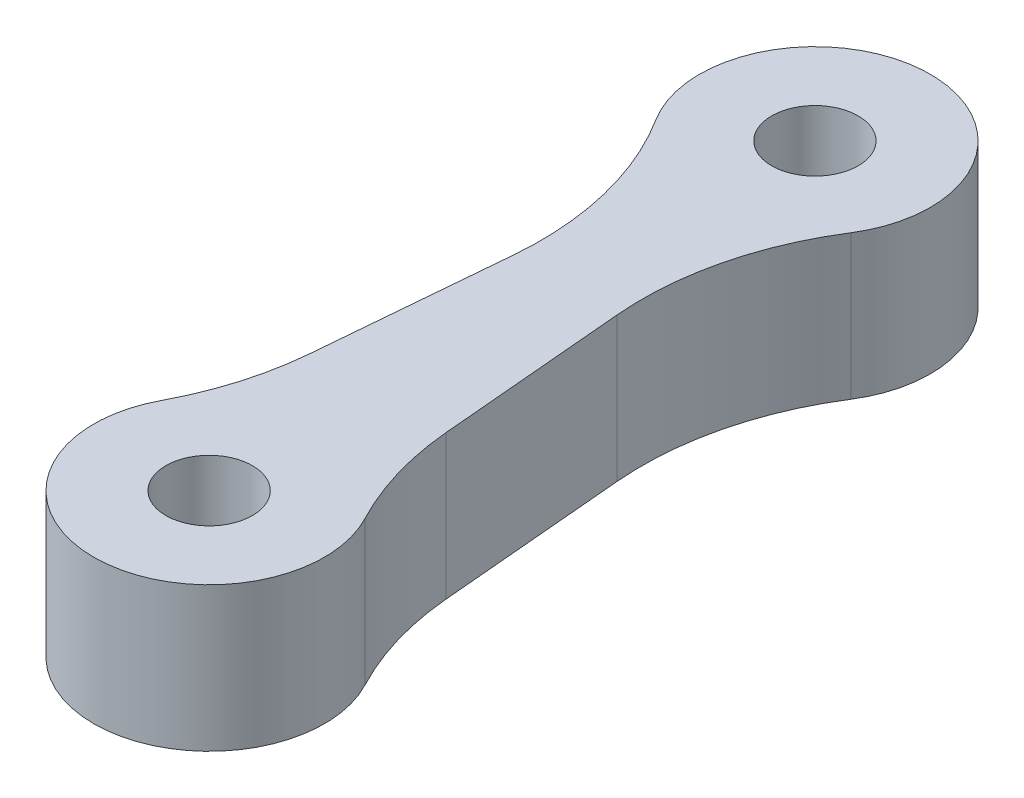
ISO-10303-21;
HEADER;
FILE_DESCRIPTION(('STEP AP214'),'2;1');
FILE_NAME('part.step','',(''),(''),'','','');
FILE_SCHEMA(('AUTOMOTIVE_DESIGN { 1 0 10303 214 1 1 1 1 }'));
ENDSEC;
DATA;
#1=APPLICATION_CONTEXT('core data for automotive mechanical design processes');
#2=APPLICATION_PROTOCOL_DEFINITION('international standard','automotive_design',2000,#1);
#3=PRODUCT_CONTEXT('',#1,'mechanical');
#4=PRODUCT('Part','Part','',(#3));
#5=PRODUCT_RELATED_PRODUCT_CATEGORY('part','',(#4));
#6=PRODUCT_DEFINITION_FORMATION('','',#4);
#7=PRODUCT_DEFINITION_CONTEXT('part definition',#1,'design');
#8=PRODUCT_DEFINITION('design','',#6,#7);
#9=PRODUCT_DEFINITION_SHAPE('','',#8);
#10=(LENGTH_UNIT() NAMED_UNIT(*) SI_UNIT(.MILLI.,.METRE.));
#11=(NAMED_UNIT(*) PLANE_ANGLE_UNIT() SI_UNIT($,.RADIAN.));
#12=(NAMED_UNIT(*) SI_UNIT($,.STERADIAN.) SOLID_ANGLE_UNIT());
#13=UNCERTAINTY_MEASURE_WITH_UNIT(LENGTH_MEASURE(1.E-05),#10,'distance_accuracy_value','');
#14=(GEOMETRIC_REPRESENTATION_CONTEXT(3) GLOBAL_UNCERTAINTY_ASSIGNED_CONTEXT((#13)) GLOBAL_UNIT_ASSIGNED_CONTEXT((#10,
#11,#12)) REPRESENTATION_CONTEXT('',''));
#15=CARTESIAN_POINT('',(0.,0.,0.));
#16=DIRECTION('',(0.,0.,1.));
#17=DIRECTION('',(1.,0.,0.));
#18=AXIS2_PLACEMENT_3D('',#15,#16,#17);
#19=CARTESIAN_POINT('',(0.,10.,42.));
#20=DIRECTION('',(0.,-1.,0.));
#21=DIRECTION('',(0.,0.,-1.));
#22=AXIS2_PLACEMENT_3D('',#19,#20,#21);
#23=CYLINDRICAL_SURFACE('',#22,8.);
#24=CARTESIAN_POINT('',(0.,0.,42.));
#25=DIRECTION('',(0.,1.,0.));
#26=DIRECTION('',(0.,0.,1.));
#27=AXIS2_PLACEMENT_3D('',#24,#25,#26);
#28=CIRCLE('',#27,8.);
#29=CARTESIAN_POINT('',(-7.07567247600929,0.,38.2670575932323));
#30=VERTEX_POINT('',#29);
#31=CARTESIAN_POINT('',(7.07567247600916,0.,38.267057593232));
#32=VERTEX_POINT('',#31);
#33=EDGE_CURVE('E142',#30,#32,#28,.T.);
#34=ORIENTED_EDGE('',*,*,#33,.T.);
#35=DIRECTION('',(0.,-1.,0.));
#36=VECTOR('',#35,1.);
#37=CARTESIAN_POINT('',(7.07567247600916,10.,38.267057593232));
#38=LINE('',#37,#36);
#39=CARTESIAN_POINT('',(7.07567247600916,10.,38.267057593232));
#40=VERTEX_POINT('',#39);
#41=EDGE_CURVE('E11',#40,#32,#38,.T.);
#42=ORIENTED_EDGE('',*,*,#41,.F.);
#43=CARTESIAN_POINT('',(0.,10.,42.));
#44=DIRECTION('',(0.,1.,0.));
#45=DIRECTION('',(0.,0.,1.));
#46=AXIS2_PLACEMENT_3D('',#43,#44,#45);
#47=CIRCLE('',#46,8.);
#48=CARTESIAN_POINT('',(-7.07567247600929,10.,38.2670575932323));
#49=VERTEX_POINT('',#48);
#50=EDGE_CURVE('E308',#49,#40,#47,.T.);
#51=ORIENTED_EDGE('',*,*,#50,.F.);
#52=DIRECTION('',(0.,-1.,0.));
#53=VECTOR('',#52,1.);
#54=CARTESIAN_POINT('',(-7.07567247600929,10.,38.2670575932323));
#55=LINE('',#54,#53);
#56=EDGE_CURVE('E54',#49,#30,#55,.T.);
#57=ORIENTED_EDGE('',*,*,#56,.T.);
#58=EDGE_LOOP('',(#34,#42,#51,#57));
#59=FACE_BOUND('',#58,.T.);
#60=ADVANCED_FACE('F37',(#59),#23,.T.);
#61=CARTESIAN_POINT('',(25.6493127255332,10.,28.4680837754661));
#62=DIRECTION('',(0.,-1.,0.));
#63=DIRECTION('',(0.,0.,-1.));
#64=AXIS2_PLACEMENT_3D('',#61,#62,#63);
#65=CYLINDRICAL_SURFACE('',#64,21.);
#66=CARTESIAN_POINT('',(25.6493127255332,0.,28.4680837754661));
#67=DIRECTION('',(0.,1.,0.));
#68=DIRECTION('',(0.,0.,1.));
#69=AXIS2_PLACEMENT_3D('',#66,#67,#68);
#70=CIRCLE('',#69,21.);
#71=CARTESIAN_POINT('',(4.72922406560649,0.,30.2983543731668));
#72=VERTEX_POINT('',#71);
#73=EDGE_CURVE('E144',#32,#72,#70,.F.);
#74=ORIENTED_EDGE('',*,*,#73,.T.);
#75=DIRECTION('',(0.,-1.,0.));
#76=VECTOR('',#75,1.);
#77=CARTESIAN_POINT('',(4.72922406560649,10.,30.2983543731668));
#78=LINE('',#77,#76);
#79=CARTESIAN_POINT('',(4.72922406560649,10.,30.2983543731668));
#80=VERTEX_POINT('',#79);
#81=EDGE_CURVE('E46',#80,#72,#78,.T.);
#82=ORIENTED_EDGE('',*,*,#81,.F.);
#83=CARTESIAN_POINT('',(25.6493127255332,10.,28.4680837754661));
#84=DIRECTION('',(0.,1.,0.));
#85=DIRECTION('',(0.,0.,1.));
#86=AXIS2_PLACEMENT_3D('',#83,#84,#85);
#87=CIRCLE('',#86,21.);
#88=EDGE_CURVE('E93',#40,#80,#87,.F.);
#89=ORIENTED_EDGE('',*,*,#88,.F.);
#90=ORIENTED_EDGE('',*,*,#41,.T.);
#91=EDGE_LOOP('',(#74,#82,#89,#90));
#92=FACE_BOUND('',#91,.T.);
#93=ADVANCED_FACE('F175',(#92),#65,.F.);
#94=CARTESIAN_POINT('',(2.06267328397039,10.,-0.180460528905185));
#95=DIRECTION('',(0.996194698091746,0.,-0.0871557427476521));
#96=DIRECTION('',(-0.0871557427476521,0.,-0.996194698091746));
#97=AXIS2_PLACEMENT_3D('',#94,#95,#96);
#98=PLANE('',#97);
#99=DIRECTION('',(0.0871557427476521,0.,0.996194698091746));
#100=VECTOR('',#99,1.);
#101=CARTESIAN_POINT('',(2.06267328397039,0.,-0.180460528905185));
#102=LINE('',#101,#100);
#103=CARTESIAN_POINT('',(3.59411058104261,0.,17.323947875031));
#104=VERTEX_POINT('',#103);
#105=EDGE_CURVE('E147',#104,#72,#102,.T.);
#106=ORIENTED_EDGE('',*,*,#105,.F.);
#107=DIRECTION('',(0.,-1.,0.));
#108=VECTOR('',#107,1.);
#109=CARTESIAN_POINT('',(3.59411058104261,10.,17.323947875031));
#110=LINE('',#109,#108);
#111=CARTESIAN_POINT('',(3.59411058104261,10.,17.323947875031));
#112=VERTEX_POINT('',#111);
#113=EDGE_CURVE('E168',#112,#104,#110,.T.);
#114=ORIENTED_EDGE('',*,*,#113,.F.);
#115=DIRECTION('',(0.0871557427476521,0.,0.996194698091746));
#116=VECTOR('',#115,1.);
#117=CARTESIAN_POINT('',(2.06267328397039,10.,-0.180460528905185));
#118=LINE('',#117,#116);
#119=EDGE_CURVE('E174',#112,#80,#118,.T.);
#120=ORIENTED_EDGE('',*,*,#119,.T.);
#121=ORIENTED_EDGE('',*,*,#81,.T.);
#122=EDGE_LOOP('',(#106,#114,#120,#121));
#123=FACE_BOUND('',#122,.T.);
#124=ADVANCED_FACE('F172',(#123),#98,.T.);
#125=CARTESIAN_POINT('',(24.5141992409693,10.,15.4936772773303));
#126=DIRECTION('',(0.,-1.,0.));
#127=DIRECTION('',(0.,0.,-1.));
#128=AXIS2_PLACEMENT_3D('',#125,#126,#127);
#129=CYLINDRICAL_SURFACE('',#128,21.);
#130=CARTESIAN_POINT('',(24.5141992409693,0.,15.4936772773303));
#131=DIRECTION('',(0.,1.,0.));
#132=DIRECTION('',(0.,0.,1.));
#133=AXIS2_PLACEMENT_3D('',#130,#131,#132);
#134=CIRCLE('',#133,21.);
#135=CARTESIAN_POINT('',(6.7625377216467,0.,4.27411786960836));
#136=VERTEX_POINT('',#135);
#137=EDGE_CURVE('E150',#104,#136,#134,.F.);
#138=ORIENTED_EDGE('',*,*,#137,.T.);
#139=DIRECTION('',(0.,-1.,0.));
#140=VECTOR('',#139,1.);
#141=CARTESIAN_POINT('',(6.7625377216467,10.,4.27411786960836));
#142=LINE('',#141,#140);
#143=CARTESIAN_POINT('',(6.7625377216467,10.,4.27411786960836));
#144=VERTEX_POINT('',#143);
#145=EDGE_CURVE('E165',#144,#136,#142,.T.);
#146=ORIENTED_EDGE('',*,*,#145,.F.);
#147=CARTESIAN_POINT('',(24.5141992409693,10.,15.4936772773303));
#148=DIRECTION('',(0.,1.,0.));
#149=DIRECTION('',(0.,0.,1.));
#150=AXIS2_PLACEMENT_3D('',#147,#148,#149);
#151=CIRCLE('',#150,21.);
#152=EDGE_CURVE('E131',#112,#144,#151,.F.);
#153=ORIENTED_EDGE('',*,*,#152,.F.);
#154=ORIENTED_EDGE('',*,*,#113,.T.);
#155=EDGE_LOOP('',(#138,#146,#153,#154));
#156=FACE_BOUND('',#155,.T.);
#157=ADVANCED_FACE('F183',(#156),#129,.F.);
#158=CARTESIAN_POINT('',(0.,10.,0.));
#159=DIRECTION('',(0.,-1.,0.));
#160=DIRECTION('',(0.,0.,-1.));
#161=AXIS2_PLACEMENT_3D('',#158,#159,#160);
#162=CYLINDRICAL_SURFACE('',#161,8.);
#163=CARTESIAN_POINT('',(0.,0.,0.));
#164=DIRECTION('',(0.,1.,0.));
#165=DIRECTION('',(0.,0.,1.));
#166=AXIS2_PLACEMENT_3D('',#163,#164,#165);
#167=CIRCLE('',#166,8.);
#168=CARTESIAN_POINT('',(-6.76253772164675,0.,4.27411786960827));
#169=VERTEX_POINT('',#168);
#170=EDGE_CURVE('E152',#136,#169,#167,.T.);
#171=ORIENTED_EDGE('',*,*,#170,.T.);
#172=DIRECTION('',(0.,-1.,0.));
#173=VECTOR('',#172,1.);
#174=CARTESIAN_POINT('',(-6.76253772164675,10.,4.27411786960827));
#175=LINE('',#174,#173);
#176=CARTESIAN_POINT('',(-6.76253772164675,10.,4.27411786960827));
#177=VERTEX_POINT('',#176);
#178=EDGE_CURVE('E118',#177,#169,#175,.T.);
#179=ORIENTED_EDGE('',*,*,#178,.F.);
#180=CARTESIAN_POINT('',(0.,10.,0.));
#181=DIRECTION('',(0.,1.,0.));
#182=DIRECTION('',(0.,0.,1.));
#183=AXIS2_PLACEMENT_3D('',#180,#181,#182);
#184=CIRCLE('',#183,8.);
#185=EDGE_CURVE('E128',#144,#177,#184,.T.);
#186=ORIENTED_EDGE('',*,*,#185,.F.);
#187=ORIENTED_EDGE('',*,*,#145,.T.);
#188=EDGE_LOOP('',(#171,#179,#186,#187));
#189=FACE_BOUND('',#188,.T.);
#190=ADVANCED_FACE('F186',(#189),#162,.T.);
#191=CARTESIAN_POINT('',(-24.5141992409695,10.,15.49367727733));
#192=DIRECTION('',(0.,-1.,0.));
#193=DIRECTION('',(0.,0.,-1.));
#194=AXIS2_PLACEMENT_3D('',#191,#192,#193);
#195=CYLINDRICAL_SURFACE('',#194,21.);
#196=CARTESIAN_POINT('',(-24.5141992409695,0.,15.49367727733));
#197=DIRECTION('',(0.,1.,0.));
#198=DIRECTION('',(0.,0.,1.));
#199=AXIS2_PLACEMENT_3D('',#196,#197,#198);
#200=CIRCLE('',#199,21.);
#201=CARTESIAN_POINT('',(-3.59411058104284,0.,17.3239478750309));
#202=VERTEX_POINT('',#201);
#203=EDGE_CURVE('E115',#202,#169,#200,.T.);
#204=ORIENTED_EDGE('',*,*,#203,.F.);
#205=DIRECTION('',(0.,-1.,0.));
#206=VECTOR('',#205,1.);
#207=CARTESIAN_POINT('',(-3.59411058104284,10.,17.3239478750309));
#208=LINE('',#207,#206);
#209=CARTESIAN_POINT('',(-3.59411058104284,10.,17.3239478750309));
#210=VERTEX_POINT('',#209);
#211=EDGE_CURVE('E109',#210,#202,#208,.T.);
#212=ORIENTED_EDGE('',*,*,#211,.F.);
#213=CARTESIAN_POINT('',(-24.5141992409695,10.,15.49367727733));
#214=DIRECTION('',(0.,1.,0.));
#215=DIRECTION('',(0.,0.,1.));
#216=AXIS2_PLACEMENT_3D('',#213,#214,#215);
#217=CIRCLE('',#216,21.);
#218=EDGE_CURVE('E113',#210,#177,#217,.T.);
#219=ORIENTED_EDGE('',*,*,#218,.T.);
#220=ORIENTED_EDGE('',*,*,#178,.T.);
#221=EDGE_LOOP('',(#204,#212,#219,#220));
#222=FACE_BOUND('',#221,.T.);
#223=ADVANCED_FACE('F111',(#222),#195,.F.);
#224=CARTESIAN_POINT('',(-2.06267328397041,10.,-0.180460528905213));
#225=DIRECTION('',(0.996194698091745,0.,0.0871557427476646));
#226=DIRECTION('',(0.0871557427476646,0.,-0.996194698091745));
#227=AXIS2_PLACEMENT_3D('',#224,#225,#226);
#228=PLANE('',#227);
#229=DIRECTION('',(-0.0871557427476646,0.,0.996194698091745));
#230=VECTOR('',#229,1.);
#231=CARTESIAN_POINT('',(-2.06267328397041,0.,-0.180460528905213));
#232=LINE('',#231,#230);
#233=CARTESIAN_POINT('',(-4.72922406560701,0.,30.2983543731681));
#234=VERTEX_POINT('',#233);
#235=EDGE_CURVE('E156',#202,#234,#232,.T.);
#236=ORIENTED_EDGE('',*,*,#235,.T.);
#237=DIRECTION('',(0.,-1.,0.));
#238=VECTOR('',#237,1.);
#239=CARTESIAN_POINT('',(-4.72922406560701,10.,30.2983543731681));
#240=LINE('',#239,#238);
#241=CARTESIAN_POINT('',(-4.72922406560701,10.,30.2983543731681));
#242=VERTEX_POINT('',#241);
#243=EDGE_CURVE('E81',#242,#234,#240,.T.);
#244=ORIENTED_EDGE('',*,*,#243,.F.);
#245=DIRECTION('',(-0.0871557427476646,0.,0.996194698091745));
#246=VECTOR('',#245,1.);
#247=CARTESIAN_POINT('',(-2.06267328397041,10.,-0.180460528905213));
#248=LINE('',#247,#246);
#249=EDGE_CURVE('E120',#210,#242,#248,.T.);
#250=ORIENTED_EDGE('',*,*,#249,.F.);
#251=ORIENTED_EDGE('',*,*,#211,.T.);
#252=EDGE_LOOP('',(#236,#244,#250,#251));
#253=FACE_BOUND('',#252,.T.);
#254=ADVANCED_FACE('F121',(#253),#228,.F.);
#255=CARTESIAN_POINT('',(0.,10.,0.));
#256=DIRECTION('',(0.,-1.,0.));
#257=DIRECTION('',(0.,0.,-1.));
#258=AXIS2_PLACEMENT_3D('',#255,#256,#257);
#259=CYLINDRICAL_SURFACE('',#258,3.);
#260=CARTESIAN_POINT('',(0.,10.,0.));
#261=DIRECTION('',(0.,1.,0.));
#262=DIRECTION('',(0.,0.,1.));
#263=AXIS2_PLACEMENT_3D('',#260,#261,#262);
#264=CIRCLE('',#263,3.);
#265=CARTESIAN_POINT('',(0.,10.,3.));
#266=VERTEX_POINT('',#265);
#267=EDGE_CURVE('E215',#266,#266,#264,.T.);
#268=ORIENTED_EDGE('',*,*,#267,.T.);
#269=EDGE_LOOP('',(#268));
#270=FACE_BOUND('',#269,.T.);
#271=CARTESIAN_POINT('',(0.,0.,0.));
#272=DIRECTION('',(0.,1.,0.));
#273=DIRECTION('',(0.,0.,1.));
#274=AXIS2_PLACEMENT_3D('',#271,#272,#273);
#275=CIRCLE('',#274,3.);
#276=CARTESIAN_POINT('',(0.,0.,3.));
#277=VERTEX_POINT('',#276);
#278=EDGE_CURVE('E139',#277,#277,#275,.T.);
#279=ORIENTED_EDGE('',*,*,#278,.F.);
#280=EDGE_LOOP('',(#279));
#281=FACE_BOUND('',#280,.T.);
#282=ADVANCED_FACE('F196',(#270,#281),#259,.F.);
#283=CARTESIAN_POINT('',(0.,10.,42.));
#284=DIRECTION('',(0.,-1.,0.));
#285=DIRECTION('',(0.,0.,-1.));
#286=AXIS2_PLACEMENT_3D('',#283,#284,#285);
#287=CYLINDRICAL_SURFACE('',#286,3.);
#288=CARTESIAN_POINT('',(0.,10.,42.));
#289=DIRECTION('',(0.,1.,0.));
#290=DIRECTION('',(0.,0.,1.));
#291=AXIS2_PLACEMENT_3D('',#288,#289,#290);
#292=CIRCLE('',#291,3.);
#293=CARTESIAN_POINT('',(0.,10.,45.));
#294=VERTEX_POINT('',#293);
#295=EDGE_CURVE('E161',#294,#294,#292,.T.);
#296=ORIENTED_EDGE('',*,*,#295,.T.);
#297=EDGE_LOOP('',(#296));
#298=FACE_BOUND('',#297,.T.);
#299=CARTESIAN_POINT('',(0.,0.,42.));
#300=DIRECTION('',(0.,1.,0.));
#301=DIRECTION('',(0.,0.,1.));
#302=AXIS2_PLACEMENT_3D('',#299,#300,#301);
#303=CIRCLE('',#302,3.);
#304=CARTESIAN_POINT('',(0.,0.,45.));
#305=VERTEX_POINT('',#304);
#306=EDGE_CURVE('E136',#305,#305,#303,.T.);
#307=ORIENTED_EDGE('',*,*,#306,.F.);
#308=EDGE_LOOP('',(#307));
#309=FACE_BOUND('',#308,.T.);
#310=ADVANCED_FACE('F39',(#298,#309),#287,.F.);
#311=CARTESIAN_POINT('',(-25.6493127255337,10.,28.4680837754671));
#312=DIRECTION('',(0.,-1.,0.));
#313=DIRECTION('',(0.,0.,-1.));
#314=AXIS2_PLACEMENT_3D('',#311,#312,#313);
#315=CYLINDRICAL_SURFACE('',#314,21.);
#316=CARTESIAN_POINT('',(-25.6493127255337,0.,28.4680837754671));
#317=DIRECTION('',(0.,1.,0.));
#318=DIRECTION('',(0.,0.,1.));
#319=AXIS2_PLACEMENT_3D('',#316,#317,#318);
#320=CIRCLE('',#319,21.);
#321=EDGE_CURVE('E158',#30,#234,#320,.T.);
#322=ORIENTED_EDGE('',*,*,#321,.F.);
#323=ORIENTED_EDGE('',*,*,#56,.F.);
#324=CARTESIAN_POINT('',(-25.6493127255337,10.,28.4680837754671));
#325=DIRECTION('',(0.,1.,0.));
#326=DIRECTION('',(0.,0.,1.));
#327=AXIS2_PLACEMENT_3D('',#324,#325,#326);
#328=CIRCLE('',#327,21.);
#329=EDGE_CURVE('E124',#49,#242,#328,.T.);
#330=ORIENTED_EDGE('',*,*,#329,.T.);
#331=ORIENTED_EDGE('',*,*,#243,.T.);
#332=EDGE_LOOP('',(#322,#323,#330,#331));
#333=FACE_BOUND('',#332,.T.);
#334=ADVANCED_FACE('F187',(#333),#315,.F.);
#335=CARTESIAN_POINT('',(0.,10.,0.));
#336=DIRECTION('',(0.,1.,0.));
#337=DIRECTION('',(0.,0.,1.));
#338=AXIS2_PLACEMENT_3D('',#335,#336,#337);
#339=PLANE('',#338);
#340=ORIENTED_EDGE('',*,*,#295,.F.);
#341=EDGE_LOOP('',(#340));
#342=FACE_BOUND('',#341,.T.);
#343=ORIENTED_EDGE('',*,*,#267,.F.);
#344=EDGE_LOOP('',(#343));
#345=FACE_BOUND('',#344,.T.);
#346=ORIENTED_EDGE('',*,*,#50,.T.);
#347=ORIENTED_EDGE('',*,*,#88,.T.);
#348=ORIENTED_EDGE('',*,*,#119,.F.);
#349=ORIENTED_EDGE('',*,*,#152,.T.);
#350=ORIENTED_EDGE('',*,*,#185,.T.);
#351=ORIENTED_EDGE('',*,*,#218,.F.);
#352=ORIENTED_EDGE('',*,*,#249,.T.);
#353=ORIENTED_EDGE('',*,*,#329,.F.);
#354=EDGE_LOOP('',(#346,#347,#348,#349,#350,#351,#352,#353));
#355=FACE_BOUND('',#354,.T.);
#356=ADVANCED_FACE('F126',(#342,#345,#355),#339,.T.);
#357=CARTESIAN_POINT('',(0.,0.,0.));
#358=DIRECTION('',(0.,1.,0.));
#359=DIRECTION('',(0.,0.,1.));
#360=AXIS2_PLACEMENT_3D('',#357,#358,#359);
#361=PLANE('',#360);
#362=ORIENTED_EDGE('',*,*,#306,.T.);
#363=EDGE_LOOP('',(#362));
#364=FACE_BOUND('',#363,.T.);
#365=ORIENTED_EDGE('',*,*,#278,.T.);
#366=EDGE_LOOP('',(#365));
#367=FACE_BOUND('',#366,.T.);
#368=ORIENTED_EDGE('',*,*,#33,.F.);
#369=ORIENTED_EDGE('',*,*,#321,.T.);
#370=ORIENTED_EDGE('',*,*,#235,.F.);
#371=ORIENTED_EDGE('',*,*,#203,.T.);
#372=ORIENTED_EDGE('',*,*,#170,.F.);
#373=ORIENTED_EDGE('',*,*,#137,.F.);
#374=ORIENTED_EDGE('',*,*,#105,.T.);
#375=ORIENTED_EDGE('',*,*,#73,.F.);
#376=EDGE_LOOP('',(#368,#369,#370,#371,#372,#373,#374,#375));
#377=FACE_BOUND('',#376,.T.);
#378=ADVANCED_FACE('F179',(#364,#367,#377),#361,.F.);
#379=CLOSED_SHELL('',(#60,#93,#124,#157,#190,#223,#254,#282,#310,#334,#356,#378));
#380=MANIFOLD_SOLID_BREP('B2',#379);
#381=ADVANCED_BREP_SHAPE_REPRESENTATION('',(#18,#380),#14);
#382=SHAPE_DEFINITION_REPRESENTATION(#9,#381);
ENDSEC;
END-ISO-10303-21;
